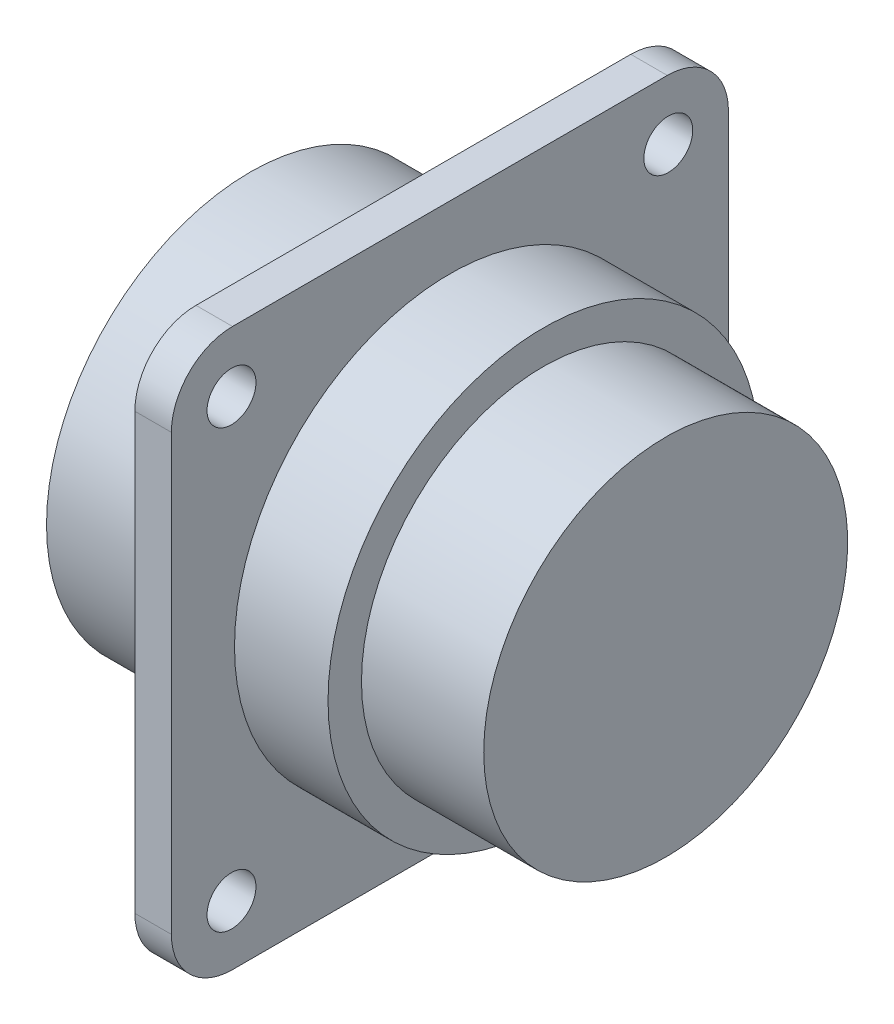
ISO-10303-21;
HEADER;
FILE_DESCRIPTION(('STEP AP214'),'2;1');
FILE_NAME('part.step','',(''),(''),'','','');
FILE_SCHEMA(('AUTOMOTIVE_DESIGN { 1 0 10303 214 1 1 1 1 }'));
ENDSEC;
DATA;
#1=APPLICATION_CONTEXT('core data for automotive mechanical design processes');
#2=APPLICATION_PROTOCOL_DEFINITION('international standard','automotive_design',2000,#1);
#3=PRODUCT_CONTEXT('',#1,'mechanical');
#4=PRODUCT('Part','Part','',(#3));
#5=PRODUCT_RELATED_PRODUCT_CATEGORY('part','',(#4));
#6=PRODUCT_DEFINITION_FORMATION('','',#4);
#7=PRODUCT_DEFINITION_CONTEXT('part definition',#1,'design');
#8=PRODUCT_DEFINITION('design','',#6,#7);
#9=PRODUCT_DEFINITION_SHAPE('','',#8);
#10=(LENGTH_UNIT() NAMED_UNIT(*) SI_UNIT(.MILLI.,.METRE.));
#11=(NAMED_UNIT(*) PLANE_ANGLE_UNIT() SI_UNIT($,.RADIAN.));
#12=(NAMED_UNIT(*) SI_UNIT($,.STERADIAN.) SOLID_ANGLE_UNIT());
#13=UNCERTAINTY_MEASURE_WITH_UNIT(LENGTH_MEASURE(1.E-05),#10,'distance_accuracy_value','');
#14=(GEOMETRIC_REPRESENTATION_CONTEXT(3) GLOBAL_UNCERTAINTY_ASSIGNED_CONTEXT((#13)) GLOBAL_UNIT_ASSIGNED_CONTEXT((#10,
#11,#12)) REPRESENTATION_CONTEXT('',''));
#15=CARTESIAN_POINT('',(0.,0.,0.));
#16=DIRECTION('',(0.,0.,1.));
#17=DIRECTION('',(1.,0.,0.));
#18=AXIS2_PLACEMENT_3D('',#15,#16,#17);
#19=CARTESIAN_POINT('',(10.67,13.335,0.));
#20=DIRECTION('',(1.,0.,0.));
#21=DIRECTION('',(0.,0.,-1.));
#22=AXIS2_PLACEMENT_3D('',#19,#20,#21);
#23=PLANE('',#22);
#24=CARTESIAN_POINT('',(10.67,0.,0.));
#25=DIRECTION('',(-1.,0.,0.));
#26=DIRECTION('',(0.,0.,1.));
#27=AXIS2_PLACEMENT_3D('',#24,#25,#26);
#28=CIRCLE('',#27,13.335);
#29=CARTESIAN_POINT('',(10.67,0.,13.335));
#30=VERTEX_POINT('',#29);
#31=EDGE_CURVE('E172',#30,#30,#28,.T.);
#32=ORIENTED_EDGE('',*,*,#31,.F.);
#33=EDGE_LOOP('',(#32));
#34=FACE_BOUND('',#33,.T.);
#35=CARTESIAN_POINT('',(10.67,14.29,-14.29));
#36=DIRECTION('',(-1.,0.,0.));
#37=DIRECTION('',(0.,0.,1.));
#38=AXIS2_PLACEMENT_3D('',#35,#36,#37);
#39=CIRCLE('',#38,1.6);
#40=CARTESIAN_POINT('',(10.67,14.29,-12.69));
#41=VERTEX_POINT('',#40);
#42=EDGE_CURVE('E156',#41,#41,#39,.T.);
#43=ORIENTED_EDGE('',*,*,#42,.F.);
#44=EDGE_LOOP('',(#43));
#45=FACE_BOUND('',#44,.T.);
#46=CARTESIAN_POINT('',(10.67,14.29,14.29));
#47=DIRECTION('',(-1.,0.,0.));
#48=DIRECTION('',(0.,0.,1.));
#49=AXIS2_PLACEMENT_3D('',#46,#47,#48);
#50=CIRCLE('',#49,1.6);
#51=CARTESIAN_POINT('',(10.67,14.29,15.89));
#52=VERTEX_POINT('',#51);
#53=EDGE_CURVE('E152',#52,#52,#50,.T.);
#54=ORIENTED_EDGE('',*,*,#53,.F.);
#55=EDGE_LOOP('',(#54));
#56=FACE_BOUND('',#55,.T.);
#57=CARTESIAN_POINT('',(10.67,-14.29,14.29));
#58=DIRECTION('',(-1.,0.,0.));
#59=DIRECTION('',(0.,0.,1.));
#60=AXIS2_PLACEMENT_3D('',#57,#58,#59);
#61=CIRCLE('',#60,1.6);
#62=CARTESIAN_POINT('',(10.67,-14.29,15.89));
#63=VERTEX_POINT('',#62);
#64=EDGE_CURVE('E148',#63,#63,#61,.T.);
#65=ORIENTED_EDGE('',*,*,#64,.F.);
#66=EDGE_LOOP('',(#65));
#67=FACE_BOUND('',#66,.T.);
#68=CARTESIAN_POINT('',(10.67,-14.29,-14.29));
#69=DIRECTION('',(-1.,0.,0.));
#70=DIRECTION('',(0.,0.,1.));
#71=AXIS2_PLACEMENT_3D('',#68,#69,#70);
#72=CIRCLE('',#71,1.6);
#73=CARTESIAN_POINT('',(10.67,-14.29,-12.69));
#74=VERTEX_POINT('',#73);
#75=EDGE_CURVE('E135',#74,#74,#72,.T.);
#76=ORIENTED_EDGE('',*,*,#75,.F.);
#77=EDGE_LOOP('',(#76));
#78=FACE_BOUND('',#77,.T.);
#79=CARTESIAN_POINT('',(10.67,14.225,14.225));
#80=DIRECTION('',(-1.,0.,0.));
#81=DIRECTION('',(0.,0.,-1.));
#82=AXIS2_PLACEMENT_3D('',#79,#80,#81);
#83=CIRCLE('',#82,4.);
#84=CARTESIAN_POINT('',(10.67,14.225,18.225));
#85=VERTEX_POINT('',#84);
#86=CARTESIAN_POINT('',(10.67,18.225,14.225));
#87=VERTEX_POINT('',#86);
#88=EDGE_CURVE('E119',#85,#87,#83,.T.);
#89=ORIENTED_EDGE('',*,*,#88,.T.);
#90=DIRECTION('',(0.,0.,-1.));
#91=VECTOR('',#90,1.);
#92=CARTESIAN_POINT('',(10.67,18.225,-14.225));
#93=LINE('',#92,#91);
#94=CARTESIAN_POINT('',(10.67,18.225,-14.225));
#95=VERTEX_POINT('',#94);
#96=EDGE_CURVE('E117',#87,#95,#93,.T.);
#97=ORIENTED_EDGE('',*,*,#96,.T.);
#98=CARTESIAN_POINT('',(10.67,14.225,-14.225));
#99=DIRECTION('',(-1.,0.,0.));
#100=DIRECTION('',(0.,0.,1.));
#101=AXIS2_PLACEMENT_3D('',#98,#99,#100);
#102=CIRCLE('',#101,4.);
#103=CARTESIAN_POINT('',(10.67,14.225,-18.225));
#104=VERTEX_POINT('',#103);
#105=EDGE_CURVE('E48',#95,#104,#102,.T.);
#106=ORIENTED_EDGE('',*,*,#105,.T.);
#107=DIRECTION('',(0.,-1.,0.));
#108=VECTOR('',#107,1.);
#109=CARTESIAN_POINT('',(10.67,14.225,-18.225));
#110=LINE('',#109,#108);
#111=CARTESIAN_POINT('',(10.67,-14.225,-18.225));
#112=VERTEX_POINT('',#111);
#113=EDGE_CURVE('E107',#104,#112,#110,.T.);
#114=ORIENTED_EDGE('',*,*,#113,.T.);
#115=CARTESIAN_POINT('',(10.67,-14.225,-14.225));
#116=DIRECTION('',(-1.,0.,0.));
#117=DIRECTION('',(0.,0.,1.));
#118=AXIS2_PLACEMENT_3D('',#115,#116,#117);
#119=CIRCLE('',#118,4.);
#120=CARTESIAN_POINT('',(10.67,-18.225,-14.225));
#121=VERTEX_POINT('',#120);
#122=EDGE_CURVE('E113',#112,#121,#119,.T.);
#123=ORIENTED_EDGE('',*,*,#122,.T.);
#124=DIRECTION('',(0.,0.,1.));
#125=VECTOR('',#124,1.);
#126=CARTESIAN_POINT('',(10.67,-18.225,-14.225));
#127=LINE('',#126,#125);
#128=CARTESIAN_POINT('',(10.67,-18.225,14.225));
#129=VERTEX_POINT('',#128);
#130=EDGE_CURVE('E124',#121,#129,#127,.T.);
#131=ORIENTED_EDGE('',*,*,#130,.T.);
#132=CARTESIAN_POINT('',(10.67,-14.225,14.225));
#133=DIRECTION('',(-1.,0.,0.));
#134=DIRECTION('',(0.,0.,1.));
#135=AXIS2_PLACEMENT_3D('',#132,#133,#134);
#136=CIRCLE('',#135,4.);
#137=CARTESIAN_POINT('',(10.67,-14.225,18.225));
#138=VERTEX_POINT('',#137);
#139=EDGE_CURVE('E127',#129,#138,#136,.T.);
#140=ORIENTED_EDGE('',*,*,#139,.T.);
#141=DIRECTION('',(0.,1.,0.));
#142=VECTOR('',#141,1.);
#143=CARTESIAN_POINT('',(10.67,14.225,18.225));
#144=LINE('',#143,#142);
#145=EDGE_CURVE('E130',#138,#85,#144,.T.);
#146=ORIENTED_EDGE('',*,*,#145,.T.);
#147=EDGE_LOOP('',(#89,#97,#106,#114,#123,#131,#140,#146));
#148=FACE_BOUND('',#147,.T.);
#149=ADVANCED_FACE('F33',(#34,#45,#56,#67,#78,#148),#23,.F.);
#150=CARTESIAN_POINT('',(13.06,30.,0.));
#151=DIRECTION('',(-1.,0.,0.));
#152=DIRECTION('',(0.,0.,1.));
#153=AXIS2_PLACEMENT_3D('',#150,#151,#152);
#154=PLANE('',#153);
#155=CARTESIAN_POINT('',(13.06,0.,0.));
#156=DIRECTION('',(-1.,0.,0.));
#157=DIRECTION('',(0.,0.,1.));
#158=AXIS2_PLACEMENT_3D('',#155,#156,#157);
#159=CIRCLE('',#158,14.095);
#160=CARTESIAN_POINT('',(13.06,0.,14.095));
#161=VERTEX_POINT('',#160);
#162=EDGE_CURVE('E169',#161,#161,#159,.T.);
#163=ORIENTED_EDGE('',*,*,#162,.T.);
#164=EDGE_LOOP('',(#163));
#165=FACE_BOUND('',#164,.T.);
#166=CARTESIAN_POINT('',(13.06,14.29,-14.29));
#167=DIRECTION('',(-1.,0.,0.));
#168=DIRECTION('',(0.,0.,1.));
#169=AXIS2_PLACEMENT_3D('',#166,#167,#168);
#170=CIRCLE('',#169,1.6);
#171=CARTESIAN_POINT('',(13.06,14.29,-12.69));
#172=VERTEX_POINT('',#171);
#173=EDGE_CURVE('E159',#172,#172,#170,.T.);
#174=ORIENTED_EDGE('',*,*,#173,.T.);
#175=EDGE_LOOP('',(#174));
#176=FACE_BOUND('',#175,.T.);
#177=CARTESIAN_POINT('',(13.06,14.29,14.29));
#178=DIRECTION('',(-1.,0.,0.));
#179=DIRECTION('',(0.,0.,1.));
#180=AXIS2_PLACEMENT_3D('',#177,#178,#179);
#181=CIRCLE('',#180,1.6);
#182=CARTESIAN_POINT('',(13.06,14.29,15.89));
#183=VERTEX_POINT('',#182);
#184=EDGE_CURVE('E155',#183,#183,#181,.T.);
#185=ORIENTED_EDGE('',*,*,#184,.T.);
#186=EDGE_LOOP('',(#185));
#187=FACE_BOUND('',#186,.T.);
#188=CARTESIAN_POINT('',(13.06,-14.29,14.29));
#189=DIRECTION('',(-1.,0.,0.));
#190=DIRECTION('',(0.,0.,1.));
#191=AXIS2_PLACEMENT_3D('',#188,#189,#190);
#192=CIRCLE('',#191,1.6);
#193=CARTESIAN_POINT('',(13.06,-14.29,15.89));
#194=VERTEX_POINT('',#193);
#195=EDGE_CURVE('E151',#194,#194,#192,.T.);
#196=ORIENTED_EDGE('',*,*,#195,.T.);
#197=EDGE_LOOP('',(#196));
#198=FACE_BOUND('',#197,.T.);
#199=CARTESIAN_POINT('',(13.06,-14.29,-14.29));
#200=DIRECTION('',(-1.,0.,0.));
#201=DIRECTION('',(0.,0.,1.));
#202=AXIS2_PLACEMENT_3D('',#199,#200,#201);
#203=CIRCLE('',#202,1.6);
#204=CARTESIAN_POINT('',(13.06,-14.29,-12.69));
#205=VERTEX_POINT('',#204);
#206=EDGE_CURVE('E147',#205,#205,#203,.T.);
#207=ORIENTED_EDGE('',*,*,#206,.T.);
#208=EDGE_LOOP('',(#207));
#209=FACE_BOUND('',#208,.T.);
#210=CARTESIAN_POINT('',(13.06,14.225,14.225));
#211=DIRECTION('',(-1.,0.,0.));
#212=DIRECTION('',(0.,0.,1.));
#213=AXIS2_PLACEMENT_3D('',#210,#211,#212);
#214=CIRCLE('',#213,4.);
#215=CARTESIAN_POINT('',(13.06,14.225,18.225));
#216=VERTEX_POINT('',#215);
#217=CARTESIAN_POINT('',(13.06,18.225,14.225));
#218=VERTEX_POINT('',#217);
#219=EDGE_CURVE('E12',#216,#218,#214,.T.);
#220=ORIENTED_EDGE('',*,*,#219,.F.);
#221=DIRECTION('',(0.,1.,0.));
#222=VECTOR('',#221,1.);
#223=CARTESIAN_POINT('',(13.06,30.,18.225));
#224=LINE('',#223,#222);
#225=CARTESIAN_POINT('',(13.06,-14.225,18.225));
#226=VERTEX_POINT('',#225);
#227=EDGE_CURVE('E41',#226,#216,#224,.T.);
#228=ORIENTED_EDGE('',*,*,#227,.F.);
#229=CARTESIAN_POINT('',(13.06,-14.225,14.225));
#230=DIRECTION('',(-1.,0.,0.));
#231=DIRECTION('',(0.,0.,1.));
#232=AXIS2_PLACEMENT_3D('',#229,#230,#231);
#233=CIRCLE('',#232,4.);
#234=CARTESIAN_POINT('',(13.06,-18.225,14.225));
#235=VERTEX_POINT('',#234);
#236=EDGE_CURVE('E195',#235,#226,#233,.T.);
#237=ORIENTED_EDGE('',*,*,#236,.F.);
#238=DIRECTION('',(0.,0.,1.));
#239=VECTOR('',#238,1.);
#240=CARTESIAN_POINT('',(13.06,-18.225,0.));
#241=LINE('',#240,#239);
#242=CARTESIAN_POINT('',(13.06,-18.225,-14.225));
#243=VERTEX_POINT('',#242);
#244=EDGE_CURVE('E193',#243,#235,#241,.T.);
#245=ORIENTED_EDGE('',*,*,#244,.F.);
#246=CARTESIAN_POINT('',(13.06,-14.225,-14.225));
#247=DIRECTION('',(-1.,0.,0.));
#248=DIRECTION('',(0.,0.,1.));
#249=AXIS2_PLACEMENT_3D('',#246,#247,#248);
#250=CIRCLE('',#249,4.);
#251=CARTESIAN_POINT('',(13.06,-14.225,-18.225));
#252=VERTEX_POINT('',#251);
#253=EDGE_CURVE('E191',#252,#243,#250,.T.);
#254=ORIENTED_EDGE('',*,*,#253,.F.);
#255=DIRECTION('',(0.,-1.,0.));
#256=VECTOR('',#255,1.);
#257=CARTESIAN_POINT('',(13.06,30.,-18.225));
#258=LINE('',#257,#256);
#259=CARTESIAN_POINT('',(13.06,14.225,-18.225));
#260=VERTEX_POINT('',#259);
#261=EDGE_CURVE('E189',#260,#252,#258,.T.);
#262=ORIENTED_EDGE('',*,*,#261,.F.);
#263=CARTESIAN_POINT('',(13.06,14.225,-14.225));
#264=DIRECTION('',(-1.,0.,0.));
#265=DIRECTION('',(0.,0.,1.));
#266=AXIS2_PLACEMENT_3D('',#263,#264,#265);
#267=CIRCLE('',#266,4.);
#268=CARTESIAN_POINT('',(13.06,18.225,-14.225));
#269=VERTEX_POINT('',#268);
#270=EDGE_CURVE('E100',#269,#260,#267,.T.);
#271=ORIENTED_EDGE('',*,*,#270,.F.);
#272=DIRECTION('',(0.,0.,-1.));
#273=VECTOR('',#272,1.);
#274=CARTESIAN_POINT('',(13.06,18.225,0.));
#275=LINE('',#274,#273);
#276=EDGE_CURVE('E178',#218,#269,#275,.T.);
#277=ORIENTED_EDGE('',*,*,#276,.F.);
#278=EDGE_LOOP('',(#220,#228,#237,#245,#254,#262,#271,#277));
#279=FACE_BOUND('',#278,.T.);
#280=ADVANCED_FACE('F209',(#165,#176,#187,#198,#209,#279),#154,.F.);
#281=CARTESIAN_POINT('',(0.,0.,0.));
#282=DIRECTION('',(1.,0.,0.));
#283=DIRECTION('',(0.,0.,-1.));
#284=AXIS2_PLACEMENT_3D('',#281,#282,#283);
#285=PLANE('',#284);
#286=CARTESIAN_POINT('',(0.,0.,0.));
#287=DIRECTION('',(-1.,0.,0.));
#288=DIRECTION('',(0.,0.,1.));
#289=AXIS2_PLACEMENT_3D('',#286,#287,#288);
#290=CIRCLE('',#289,12.);
#291=CARTESIAN_POINT('',(0.,0.,12.));
#292=VERTEX_POINT('',#291);
#293=EDGE_CURVE('E213',#292,#292,#290,.T.);
#294=ORIENTED_EDGE('',*,*,#293,.F.);
#295=EDGE_LOOP('',(#294));
#296=FACE_BOUND('',#295,.T.);
#297=CARTESIAN_POINT('',(0.,0.,0.));
#298=DIRECTION('',(-1.,0.,0.));
#299=DIRECTION('',(0.,0.,1.));
#300=AXIS2_PLACEMENT_3D('',#297,#298,#299);
#301=CIRCLE('',#300,13.335);
#302=CARTESIAN_POINT('',(0.,0.,13.335));
#303=VERTEX_POINT('',#302);
#304=EDGE_CURVE('E175',#303,#303,#301,.T.);
#305=ORIENTED_EDGE('',*,*,#304,.T.);
#306=EDGE_LOOP('',(#305));
#307=FACE_BOUND('',#306,.T.);
#308=ADVANCED_FACE('F35',(#296,#307),#285,.F.);
#309=CARTESIAN_POINT('',(0.,0.,0.));
#310=DIRECTION('',(-1.,0.,0.));
#311=DIRECTION('',(0.,0.,1.));
#312=AXIS2_PLACEMENT_3D('',#309,#310,#311);
#313=CYLINDRICAL_SURFACE('',#312,13.335);
#314=ORIENTED_EDGE('',*,*,#304,.F.);
#315=EDGE_LOOP('',(#314));
#316=FACE_BOUND('',#315,.T.);
#317=ORIENTED_EDGE('',*,*,#31,.T.);
#318=EDGE_LOOP('',(#317));
#319=FACE_BOUND('',#318,.T.);
#320=ADVANCED_FACE('F223',(#316,#319),#313,.T.);
#321=CARTESIAN_POINT('',(0.,0.,0.));
#322=DIRECTION('',(-1.,0.,0.));
#323=DIRECTION('',(0.,0.,1.));
#324=AXIS2_PLACEMENT_3D('',#321,#322,#323);
#325=CYLINDRICAL_SURFACE('',#324,14.095);
#326=ORIENTED_EDGE('',*,*,#162,.F.);
#327=EDGE_LOOP('',(#326));
#328=FACE_BOUND('',#327,.T.);
#329=CARTESIAN_POINT('',(19.18,0.,0.));
#330=DIRECTION('',(-1.,0.,0.));
#331=DIRECTION('',(0.,0.,1.));
#332=AXIS2_PLACEMENT_3D('',#329,#330,#331);
#333=CIRCLE('',#332,14.095);
#334=CARTESIAN_POINT('',(19.18,0.,14.095));
#335=VERTEX_POINT('',#334);
#336=EDGE_CURVE('E166',#335,#335,#333,.T.);
#337=ORIENTED_EDGE('',*,*,#336,.T.);
#338=EDGE_LOOP('',(#337));
#339=FACE_BOUND('',#338,.T.);
#340=ADVANCED_FACE('F228',(#328,#339),#325,.T.);
#341=CARTESIAN_POINT('',(19.18,14.095,0.));
#342=DIRECTION('',(-1.,0.,0.));
#343=DIRECTION('',(0.,0.,1.));
#344=AXIS2_PLACEMENT_3D('',#341,#342,#343);
#345=PLANE('',#344);
#346=ORIENTED_EDGE('',*,*,#336,.F.);
#347=EDGE_LOOP('',(#346));
#348=FACE_BOUND('',#347,.T.);
#349=CARTESIAN_POINT('',(19.18,0.,0.));
#350=DIRECTION('',(-1.,0.,0.));
#351=DIRECTION('',(0.,0.,1.));
#352=AXIS2_PLACEMENT_3D('',#349,#350,#351);
#353=CIRCLE('',#352,11.90625);
#354=CARTESIAN_POINT('',(19.18,0.,11.90625));
#355=VERTEX_POINT('',#354);
#356=EDGE_CURVE('E163',#355,#355,#353,.T.);
#357=ORIENTED_EDGE('',*,*,#356,.T.);
#358=EDGE_LOOP('',(#357));
#359=FACE_BOUND('',#358,.T.);
#360=ADVANCED_FACE('F258',(#348,#359),#345,.F.);
#361=CARTESIAN_POINT('',(0.,0.,0.));
#362=DIRECTION('',(-1.,0.,0.));
#363=DIRECTION('',(0.,0.,1.));
#364=AXIS2_PLACEMENT_3D('',#361,#362,#363);
#365=CYLINDRICAL_SURFACE('',#364,11.90625);
#366=ORIENTED_EDGE('',*,*,#356,.F.);
#367=EDGE_LOOP('',(#366));
#368=FACE_BOUND('',#367,.T.);
#369=CARTESIAN_POINT('',(27.18,0.,0.));
#370=DIRECTION('',(-1.,0.,0.));
#371=DIRECTION('',(0.,0.,1.));
#372=AXIS2_PLACEMENT_3D('',#369,#370,#371);
#373=CIRCLE('',#372,11.90625);
#374=CARTESIAN_POINT('',(27.18,0.,11.90625));
#375=VERTEX_POINT('',#374);
#376=EDGE_CURVE('E160',#375,#375,#373,.T.);
#377=ORIENTED_EDGE('',*,*,#376,.T.);
#378=EDGE_LOOP('',(#377));
#379=FACE_BOUND('',#378,.T.);
#380=ADVANCED_FACE('F262',(#368,#379),#365,.T.);
#381=CARTESIAN_POINT('',(27.18,11.90625,0.));
#382=DIRECTION('',(-1.,0.,0.));
#383=DIRECTION('',(0.,0.,1.));
#384=AXIS2_PLACEMENT_3D('',#381,#382,#383);
#385=PLANE('',#384);
#386=ORIENTED_EDGE('',*,*,#376,.F.);
#387=EDGE_LOOP('',(#386));
#388=FACE_BOUND('',#387,.T.);
#389=ADVANCED_FACE('F266',(#388),#385,.F.);
#390=CARTESIAN_POINT('',(20.67,14.29,-14.29));
#391=DIRECTION('',(-1.,0.,0.));
#392=DIRECTION('',(0.,0.,1.));
#393=AXIS2_PLACEMENT_3D('',#390,#391,#392);
#394=CYLINDRICAL_SURFACE('',#393,1.6);
#395=ORIENTED_EDGE('',*,*,#42,.T.);
#396=EDGE_LOOP('',(#395));
#397=FACE_BOUND('',#396,.T.);
#398=ORIENTED_EDGE('',*,*,#173,.F.);
#399=EDGE_LOOP('',(#398));
#400=FACE_BOUND('',#399,.T.);
#401=ADVANCED_FACE('F270',(#397,#400),#394,.F.);
#402=CARTESIAN_POINT('',(20.67,14.29,14.29));
#403=DIRECTION('',(-1.,0.,0.));
#404=DIRECTION('',(0.,0.,1.));
#405=AXIS2_PLACEMENT_3D('',#402,#403,#404);
#406=CYLINDRICAL_SURFACE('',#405,1.6);
#407=ORIENTED_EDGE('',*,*,#53,.T.);
#408=EDGE_LOOP('',(#407));
#409=FACE_BOUND('',#408,.T.);
#410=ORIENTED_EDGE('',*,*,#184,.F.);
#411=EDGE_LOOP('',(#410));
#412=FACE_BOUND('',#411,.T.);
#413=ADVANCED_FACE('F274',(#409,#412),#406,.F.);
#414=CARTESIAN_POINT('',(20.67,-14.29,14.29));
#415=DIRECTION('',(-1.,0.,0.));
#416=DIRECTION('',(0.,0.,1.));
#417=AXIS2_PLACEMENT_3D('',#414,#415,#416);
#418=CYLINDRICAL_SURFACE('',#417,1.6);
#419=ORIENTED_EDGE('',*,*,#64,.T.);
#420=EDGE_LOOP('',(#419));
#421=FACE_BOUND('',#420,.T.);
#422=ORIENTED_EDGE('',*,*,#195,.F.);
#423=EDGE_LOOP('',(#422));
#424=FACE_BOUND('',#423,.T.);
#425=ADVANCED_FACE('F245',(#421,#424),#418,.F.);
#426=CARTESIAN_POINT('',(20.67,-14.29,-14.29));
#427=DIRECTION('',(-1.,0.,0.));
#428=DIRECTION('',(0.,0.,1.));
#429=AXIS2_PLACEMENT_3D('',#426,#427,#428);
#430=CYLINDRICAL_SURFACE('',#429,1.6);
#431=ORIENTED_EDGE('',*,*,#75,.T.);
#432=EDGE_LOOP('',(#431));
#433=FACE_BOUND('',#432,.T.);
#434=ORIENTED_EDGE('',*,*,#206,.F.);
#435=EDGE_LOOP('',(#434));
#436=FACE_BOUND('',#435,.T.);
#437=ADVANCED_FACE('F242',(#433,#436),#430,.F.);
#438=CARTESIAN_POINT('',(20.67,14.225,14.225));
#439=DIRECTION('',(-1.,0.,0.));
#440=DIRECTION('',(0.,0.,1.));
#441=AXIS2_PLACEMENT_3D('',#438,#439,#440);
#442=CYLINDRICAL_SURFACE('',#441,4.);
#443=ORIENTED_EDGE('',*,*,#219,.T.);
#444=DIRECTION('',(-1.,0.,0.));
#445=VECTOR('',#444,1.);
#446=CARTESIAN_POINT('',(20.67,18.225,14.225));
#447=LINE('',#446,#445);
#448=EDGE_CURVE('E56',#218,#87,#447,.T.);
#449=ORIENTED_EDGE('',*,*,#448,.T.);
#450=ORIENTED_EDGE('',*,*,#88,.F.);
#451=DIRECTION('',(-1.,0.,0.));
#452=VECTOR('',#451,1.);
#453=CARTESIAN_POINT('',(20.67,14.225,18.225));
#454=LINE('',#453,#452);
#455=EDGE_CURVE('E133',#216,#85,#454,.T.);
#456=ORIENTED_EDGE('',*,*,#455,.F.);
#457=EDGE_LOOP('',(#443,#449,#450,#456));
#458=FACE_BOUND('',#457,.T.);
#459=ADVANCED_FACE('F207',(#458),#442,.T.);
#460=CARTESIAN_POINT('',(20.67,14.225,18.225));
#461=DIRECTION('',(0.,0.,1.));
#462=DIRECTION('',(0.,-1.,0.));
#463=AXIS2_PLACEMENT_3D('',#460,#461,#462);
#464=PLANE('',#463);
#465=ORIENTED_EDGE('',*,*,#227,.T.);
#466=ORIENTED_EDGE('',*,*,#455,.T.);
#467=ORIENTED_EDGE('',*,*,#145,.F.);
#468=DIRECTION('',(-1.,0.,0.));
#469=VECTOR('',#468,1.);
#470=CARTESIAN_POINT('',(20.67,-14.225,18.225));
#471=LINE('',#470,#469);
#472=EDGE_CURVE('E136',#226,#138,#471,.T.);
#473=ORIENTED_EDGE('',*,*,#472,.F.);
#474=EDGE_LOOP('',(#465,#466,#467,#473));
#475=FACE_BOUND('',#474,.T.);
#476=ADVANCED_FACE('F200',(#475),#464,.T.);
#477=CARTESIAN_POINT('',(20.67,-14.225,14.225));
#478=DIRECTION('',(-1.,0.,0.));
#479=DIRECTION('',(0.,0.,1.));
#480=AXIS2_PLACEMENT_3D('',#477,#478,#479);
#481=CYLINDRICAL_SURFACE('',#480,4.);
#482=ORIENTED_EDGE('',*,*,#236,.T.);
#483=ORIENTED_EDGE('',*,*,#472,.T.);
#484=ORIENTED_EDGE('',*,*,#139,.F.);
#485=DIRECTION('',(-1.,0.,0.));
#486=VECTOR('',#485,1.);
#487=CARTESIAN_POINT('',(20.67,-18.225,14.225));
#488=LINE('',#487,#486);
#489=EDGE_CURVE('E138',#235,#129,#488,.T.);
#490=ORIENTED_EDGE('',*,*,#489,.F.);
#491=EDGE_LOOP('',(#482,#483,#484,#490));
#492=FACE_BOUND('',#491,.T.);
#493=ADVANCED_FACE('F297',(#492),#481,.T.);
#494=CARTESIAN_POINT('',(20.67,-18.225,-14.225));
#495=DIRECTION('',(0.,-1.,0.));
#496=DIRECTION('',(0.,0.,-1.));
#497=AXIS2_PLACEMENT_3D('',#494,#495,#496);
#498=PLANE('',#497);
#499=ORIENTED_EDGE('',*,*,#244,.T.);
#500=ORIENTED_EDGE('',*,*,#489,.T.);
#501=ORIENTED_EDGE('',*,*,#130,.F.);
#502=DIRECTION('',(-1.,0.,0.));
#503=VECTOR('',#502,1.);
#504=CARTESIAN_POINT('',(20.67,-18.225,-14.225));
#505=LINE('',#504,#503);
#506=EDGE_CURVE('E140',#243,#121,#505,.T.);
#507=ORIENTED_EDGE('',*,*,#506,.F.);
#508=EDGE_LOOP('',(#499,#500,#501,#507));
#509=FACE_BOUND('',#508,.T.);
#510=ADVANCED_FACE('F293',(#509),#498,.T.);
#511=CARTESIAN_POINT('',(20.67,-14.225,-14.225));
#512=DIRECTION('',(-1.,0.,0.));
#513=DIRECTION('',(0.,0.,1.));
#514=AXIS2_PLACEMENT_3D('',#511,#512,#513);
#515=CYLINDRICAL_SURFACE('',#514,4.);
#516=ORIENTED_EDGE('',*,*,#253,.T.);
#517=ORIENTED_EDGE('',*,*,#506,.T.);
#518=ORIENTED_EDGE('',*,*,#122,.F.);
#519=DIRECTION('',(-1.,0.,0.));
#520=VECTOR('',#519,1.);
#521=CARTESIAN_POINT('',(20.67,-14.225,-18.225));
#522=LINE('',#521,#520);
#523=EDGE_CURVE('E103',#252,#112,#522,.T.);
#524=ORIENTED_EDGE('',*,*,#523,.F.);
#525=EDGE_LOOP('',(#516,#517,#518,#524));
#526=FACE_BOUND('',#525,.T.);
#527=ADVANCED_FACE('F290',(#526),#515,.T.);
#528=CARTESIAN_POINT('',(20.67,14.225,-18.225));
#529=DIRECTION('',(0.,0.,-1.));
#530=DIRECTION('',(0.,1.,0.));
#531=AXIS2_PLACEMENT_3D('',#528,#529,#530);
#532=PLANE('',#531);
#533=ORIENTED_EDGE('',*,*,#261,.T.);
#534=ORIENTED_EDGE('',*,*,#523,.T.);
#535=ORIENTED_EDGE('',*,*,#113,.F.);
#536=DIRECTION('',(-1.,0.,0.));
#537=VECTOR('',#536,1.);
#538=CARTESIAN_POINT('',(20.67,14.225,-18.225));
#539=LINE('',#538,#537);
#540=EDGE_CURVE('E96',#260,#104,#539,.T.);
#541=ORIENTED_EDGE('',*,*,#540,.F.);
#542=EDGE_LOOP('',(#533,#534,#535,#541));
#543=FACE_BOUND('',#542,.T.);
#544=ADVANCED_FACE('F108',(#543),#532,.T.);
#545=CARTESIAN_POINT('',(20.67,14.225,-14.225));
#546=DIRECTION('',(-1.,0.,0.));
#547=DIRECTION('',(0.,0.,1.));
#548=AXIS2_PLACEMENT_3D('',#545,#546,#547);
#549=CYLINDRICAL_SURFACE('',#548,4.);
#550=ORIENTED_EDGE('',*,*,#270,.T.);
#551=ORIENTED_EDGE('',*,*,#540,.T.);
#552=ORIENTED_EDGE('',*,*,#105,.F.);
#553=DIRECTION('',(-1.,0.,0.));
#554=VECTOR('',#553,1.);
#555=CARTESIAN_POINT('',(20.67,18.225,-14.225));
#556=LINE('',#555,#554);
#557=EDGE_CURVE('E104',#269,#95,#556,.T.);
#558=ORIENTED_EDGE('',*,*,#557,.F.);
#559=EDGE_LOOP('',(#550,#551,#552,#558));
#560=FACE_BOUND('',#559,.T.);
#561=ADVANCED_FACE('F98',(#560),#549,.T.);
#562=CARTESIAN_POINT('',(20.67,18.225,-14.225));
#563=DIRECTION('',(0.,1.,0.));
#564=DIRECTION('',(0.,0.,1.));
#565=AXIS2_PLACEMENT_3D('',#562,#563,#564);
#566=PLANE('',#565);
#567=ORIENTED_EDGE('',*,*,#276,.T.);
#568=ORIENTED_EDGE('',*,*,#557,.T.);
#569=ORIENTED_EDGE('',*,*,#96,.F.);
#570=ORIENTED_EDGE('',*,*,#448,.F.);
#571=EDGE_LOOP('',(#567,#568,#569,#570));
#572=FACE_BOUND('',#571,.T.);
#573=ADVANCED_FACE('F210',(#572),#566,.T.);
#574=CARTESIAN_POINT('',(10.,0.,0.));
#575=DIRECTION('',(-1.,0.,0.));
#576=DIRECTION('',(0.,0.,1.));
#577=AXIS2_PLACEMENT_3D('',#574,#575,#576);
#578=CYLINDRICAL_SURFACE('',#577,12.);
#579=CARTESIAN_POINT('',(10.,0.,0.));
#580=DIRECTION('',(-1.,0.,0.));
#581=DIRECTION('',(0.,0.,1.));
#582=AXIS2_PLACEMENT_3D('',#579,#580,#581);
#583=CIRCLE('',#582,12.);
#584=CARTESIAN_POINT('',(10.,0.,12.));
#585=VERTEX_POINT('',#584);
#586=EDGE_CURVE('E211',#585,#585,#583,.T.);
#587=ORIENTED_EDGE('',*,*,#586,.F.);
#588=EDGE_LOOP('',(#587));
#589=FACE_BOUND('',#588,.T.);
#590=ORIENTED_EDGE('',*,*,#293,.T.);
#591=EDGE_LOOP('',(#590));
#592=FACE_BOUND('',#591,.T.);
#593=ADVANCED_FACE('F219',(#589,#592),#578,.F.);
#594=CARTESIAN_POINT('',(10.,0.,0.));
#595=DIRECTION('',(-1.,0.,0.));
#596=DIRECTION('',(0.,0.,1.));
#597=AXIS2_PLACEMENT_3D('',#594,#595,#596);
#598=PLANE('',#597);
#599=ORIENTED_EDGE('',*,*,#586,.T.);
#600=EDGE_LOOP('',(#599));
#601=FACE_BOUND('',#600,.T.);
#602=ADVANCED_FACE('F306',(#601),#598,.T.);
#603=CLOSED_SHELL('',(#149,#280,#308,#320,#340,#360,#380,#389,#401,#413,#425,#437,#459,#476,
#493,#510,#527,#544,#561,#573,#593,#602));
#604=MANIFOLD_SOLID_BREP('B2',#603);
#605=ADVANCED_BREP_SHAPE_REPRESENTATION('',(#18,#604),#14);
#606=SHAPE_DEFINITION_REPRESENTATION(#9,#605);
ENDSEC;
END-ISO-10303-21;
